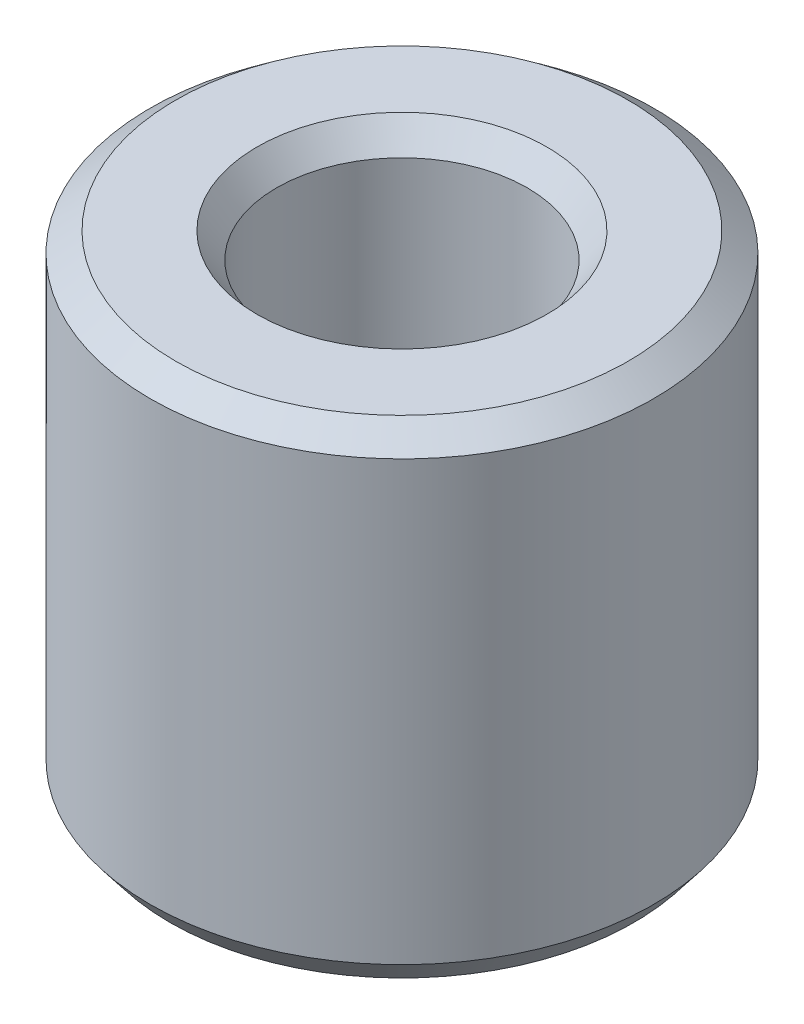
ISO-10303-21;
HEADER;
FILE_DESCRIPTION(('STEP AP214'),'2;1');
FILE_NAME('part.step','',(''),(''),'','','');
FILE_SCHEMA(('AUTOMOTIVE_DESIGN { 1 0 10303 214 1 1 1 1 }'));
ENDSEC;
DATA;
#1=APPLICATION_CONTEXT('core data for automotive mechanical design processes');
#2=APPLICATION_PROTOCOL_DEFINITION('international standard','automotive_design',2000,#1);
#3=PRODUCT_CONTEXT('',#1,'mechanical');
#4=PRODUCT('Part','Part','',(#3));
#5=PRODUCT_RELATED_PRODUCT_CATEGORY('part','',(#4));
#6=PRODUCT_DEFINITION_FORMATION('','',#4);
#7=PRODUCT_DEFINITION_CONTEXT('part definition',#1,'design');
#8=PRODUCT_DEFINITION('design','',#6,#7);
#9=PRODUCT_DEFINITION_SHAPE('','',#8);
#10=(LENGTH_UNIT() NAMED_UNIT(*) SI_UNIT(.MILLI.,.METRE.));
#11=(NAMED_UNIT(*) PLANE_ANGLE_UNIT() SI_UNIT($,.RADIAN.));
#12=(NAMED_UNIT(*) SI_UNIT($,.STERADIAN.) SOLID_ANGLE_UNIT());
#13=UNCERTAINTY_MEASURE_WITH_UNIT(LENGTH_MEASURE(1.E-05),#10,'distance_accuracy_value','');
#14=(GEOMETRIC_REPRESENTATION_CONTEXT(3) GLOBAL_UNCERTAINTY_ASSIGNED_CONTEXT((#13)) GLOBAL_UNIT_ASSIGNED_CONTEXT((#10,
#11,#12)) REPRESENTATION_CONTEXT('',''));
#15=CARTESIAN_POINT('',(0.,0.,0.));
#16=DIRECTION('',(0.,0.,1.));
#17=DIRECTION('',(1.,0.,0.));
#18=AXIS2_PLACEMENT_3D('',#15,#16,#17);
#19=CARTESIAN_POINT('',(0.,67.1847489368802,0.));
#20=DIRECTION('',(0.,-1.,0.));
#21=DIRECTION('',(0.,0.,-1.));
#22=AXIS2_PLACEMENT_3D('',#19,#20,#21);
#23=CYLINDRICAL_SURFACE('',#22,35.);
#24=CARTESIAN_POINT('',(0.,3.54333835275029,0.));
#25=DIRECTION('',(0.,1.,0.));
#26=DIRECTION('',(0.,0.,1.));
#27=AXIS2_PLACEMENT_3D('',#24,#25,#26);
#28=CIRCLE('',#27,35.);
#29=CARTESIAN_POINT('',(0.,3.54333835275029,35.));
#30=VERTEX_POINT('',#29);
#31=EDGE_CURVE('E10',#30,#30,#28,.T.);
#32=ORIENTED_EDGE('',*,*,#31,.T.);
#33=EDGE_LOOP('',(#32));
#34=FACE_BOUND('',#33,.T.);
#35=CARTESIAN_POINT('',(0.,64.4449236886331,0.));
#36=DIRECTION('',(0.,1.,0.));
#37=DIRECTION('',(0.,0.,1.));
#38=AXIS2_PLACEMENT_3D('',#35,#36,#37);
#39=CIRCLE('',#38,35.);
#40=CARTESIAN_POINT('',(0.,64.4449236886331,35.));
#41=VERTEX_POINT('',#40);
#42=EDGE_CURVE('E50',#41,#41,#39,.F.);
#43=ORIENTED_EDGE('',*,*,#42,.T.);
#44=EDGE_LOOP('',(#43));
#45=FACE_BOUND('',#44,.T.);
#46=ADVANCED_FACE('F39',(#34,#45),#23,.T.);
#47=CARTESIAN_POINT('',(0.,67.1847489368802,0.));
#48=DIRECTION('',(0.,1.,0.));
#49=DIRECTION('',(0.,0.,1.));
#50=AXIS2_PLACEMENT_3D('',#47,#48,#49);
#51=PLANE('',#50);
#52=CARTESIAN_POINT('',(0.,67.1847489368802,0.));
#53=DIRECTION('',(0.,1.,0.));
#54=DIRECTION('',(0.,0.,1.));
#55=AXIS2_PLACEMENT_3D('',#52,#53,#54);
#56=CIRCLE('',#55,20.1613589115307);
#57=CARTESIAN_POINT('',(0.,67.1847489368802,20.1613589115307));
#58=VERTEX_POINT('',#57);
#59=EDGE_CURVE('E58',#58,#58,#56,.F.);
#60=ORIENTED_EDGE('',*,*,#59,.T.);
#61=EDGE_LOOP('',(#60));
#62=FACE_BOUND('',#61,.T.);
#63=CARTESIAN_POINT('',(0.,67.1847489368802,0.));
#64=DIRECTION('',(0.,1.,0.));
#65=DIRECTION('',(0.,0.,1.));
#66=AXIS2_PLACEMENT_3D('',#63,#64,#65);
#67=CIRCLE('',#66,31.4566616472497);
#68=CARTESIAN_POINT('',(0.,67.1847489368802,31.4566616472497));
#69=VERTEX_POINT('',#68);
#70=EDGE_CURVE('E61',#69,#69,#67,.T.);
#71=ORIENTED_EDGE('',*,*,#70,.T.);
#72=EDGE_LOOP('',(#71));
#73=FACE_BOUND('',#72,.T.);
#74=ADVANCED_FACE('F88',(#62,#73),#51,.T.);
#75=CARTESIAN_POINT('',(0.,0.,0.));
#76=DIRECTION('',(0.,1.,0.));
#77=DIRECTION('',(0.,0.,1.));
#78=AXIS2_PLACEMENT_3D('',#75,#76,#77);
#79=PLANE('',#78);
#80=CARTESIAN_POINT('',(0.,0.,0.));
#81=DIRECTION('',(0.,1.,0.));
#82=DIRECTION('',(0.,0.,1.));
#83=AXIS2_PLACEMENT_3D('',#80,#81,#82);
#84=CIRCLE('',#83,20.9648720160338);
#85=CARTESIAN_POINT('',(0.,0.,20.9648720160338));
#86=VERTEX_POINT('',#85);
#87=EDGE_CURVE('E51',#86,#86,#84,.T.);
#88=ORIENTED_EDGE('',*,*,#87,.T.);
#89=EDGE_LOOP('',(#88));
#90=FACE_BOUND('',#89,.T.);
#91=CARTESIAN_POINT('',(0.,0.,0.));
#92=DIRECTION('',(0.,1.,0.));
#93=DIRECTION('',(0.,0.,1.));
#94=AXIS2_PLACEMENT_3D('',#91,#92,#93);
#95=CIRCLE('',#94,32.2601747517529);
#96=CARTESIAN_POINT('',(0.,0.,32.2601747517529));
#97=VERTEX_POINT('',#96);
#98=EDGE_CURVE('E54',#97,#97,#95,.F.);
#99=ORIENTED_EDGE('',*,*,#98,.T.);
#100=EDGE_LOOP('',(#99));
#101=FACE_BOUND('',#100,.T.);
#102=ADVANCED_FACE('F83',(#90,#101),#79,.F.);
#103=CARTESIAN_POINT('',(0.,67.1847489368802,0.));
#104=DIRECTION('',(0.,-1.,0.));
#105=DIRECTION('',(0.,0.,-1.));
#106=AXIS2_PLACEMENT_3D('',#103,#104,#105);
#107=CYLINDRICAL_SURFACE('',#106,17.4215336632835);
#108=CARTESIAN_POINT('',(0.,63.6414105841299,0.));
#109=DIRECTION('',(0.,1.,0.));
#110=DIRECTION('',(0.,0.,1.));
#111=AXIS2_PLACEMENT_3D('',#108,#109,#110);
#112=CIRCLE('',#111,17.4215336632835);
#113=CARTESIAN_POINT('',(0.,63.6414105841299,17.4215336632835));
#114=VERTEX_POINT('',#113);
#115=EDGE_CURVE('E67',#114,#114,#112,.T.);
#116=ORIENTED_EDGE('',*,*,#115,.T.);
#117=EDGE_LOOP('',(#116));
#118=FACE_BOUND('',#117,.T.);
#119=CARTESIAN_POINT('',(0.,2.73982524824713,0.));
#120=DIRECTION('',(0.,1.,0.));
#121=DIRECTION('',(0.,0.,1.));
#122=AXIS2_PLACEMENT_3D('',#119,#120,#121);
#123=CIRCLE('',#122,17.4215336632835);
#124=CARTESIAN_POINT('',(0.,2.73982524824713,17.4215336632835));
#125=VERTEX_POINT('',#124);
#126=EDGE_CURVE('E69',#125,#125,#123,.F.);
#127=ORIENTED_EDGE('',*,*,#126,.T.);
#128=EDGE_LOOP('',(#127));
#129=FACE_BOUND('',#128,.T.);
#130=ADVANCED_FACE('F71',(#118,#129),#107,.F.);
#131=CARTESIAN_POINT('',(0.,63.6414105841299,0.));
#132=DIRECTION('',(0.,1.,0.));
#133=DIRECTION('',(0.,0.,1.));
#134=AXIS2_PLACEMENT_3D('',#131,#132,#133);
#135=CONICAL_SURFACE('',#134,17.4215336632835,0.658205021416918);
#136=ORIENTED_EDGE('',*,*,#59,.F.);
#137=EDGE_LOOP('',(#136));
#138=FACE_BOUND('',#137,.T.);
#139=ORIENTED_EDGE('',*,*,#115,.F.);
#140=EDGE_LOOP('',(#139));
#141=FACE_BOUND('',#140,.T.);
#142=ADVANCED_FACE('F77',(#138,#141),#135,.F.);
#143=CARTESIAN_POINT('',(0.,0.,0.));
#144=DIRECTION('',(0.,-1.,0.));
#145=DIRECTION('',(0.,0.,-1.));
#146=AXIS2_PLACEMENT_3D('',#143,#144,#145);
#147=CONICAL_SURFACE('',#146,20.9648720160338,0.91259130537798);
#148=ORIENTED_EDGE('',*,*,#126,.F.);
#149=EDGE_LOOP('',(#148));
#150=FACE_BOUND('',#149,.T.);
#151=ORIENTED_EDGE('',*,*,#87,.F.);
#152=EDGE_LOOP('',(#151));
#153=FACE_BOUND('',#152,.T.);
#154=ADVANCED_FACE('F73',(#150,#153),#147,.F.);
#155=CARTESIAN_POINT('',(0.,3.54333835275029,0.));
#156=DIRECTION('',(0.,1.,0.));
#157=DIRECTION('',(0.,0.,1.));
#158=AXIS2_PLACEMENT_3D('',#155,#156,#157);
#159=CONICAL_SURFACE('',#158,35.,0.658205021416914);
#160=ORIENTED_EDGE('',*,*,#98,.F.);
#161=EDGE_LOOP('',(#160));
#162=FACE_BOUND('',#161,.T.);
#163=ORIENTED_EDGE('',*,*,#31,.F.);
#164=EDGE_LOOP('',(#163));
#165=FACE_BOUND('',#164,.T.);
#166=ADVANCED_FACE('F76',(#162,#165),#159,.T.);
#167=CARTESIAN_POINT('',(0.,67.1847489368802,0.));
#168=DIRECTION('',(0.,-1.,0.));
#169=DIRECTION('',(0.,0.,-1.));
#170=AXIS2_PLACEMENT_3D('',#167,#168,#169);
#171=CONICAL_SURFACE('',#170,31.4566616472497,0.912591305377984);
#172=ORIENTED_EDGE('',*,*,#42,.F.);
#173=EDGE_LOOP('',(#172));
#174=FACE_BOUND('',#173,.T.);
#175=ORIENTED_EDGE('',*,*,#70,.F.);
#176=EDGE_LOOP('',(#175));
#177=FACE_BOUND('',#176,.T.);
#178=ADVANCED_FACE('F45',(#174,#177),#171,.T.);
#179=CLOSED_SHELL('',(#46,#74,#102,#130,#142,#154,#166,#178));
#180=MANIFOLD_SOLID_BREP('B2',#179);
#181=ADVANCED_BREP_SHAPE_REPRESENTATION('',(#18,#180),#14);
#182=SHAPE_DEFINITION_REPRESENTATION(#9,#181);
ENDSEC;
END-ISO-10303-21;
